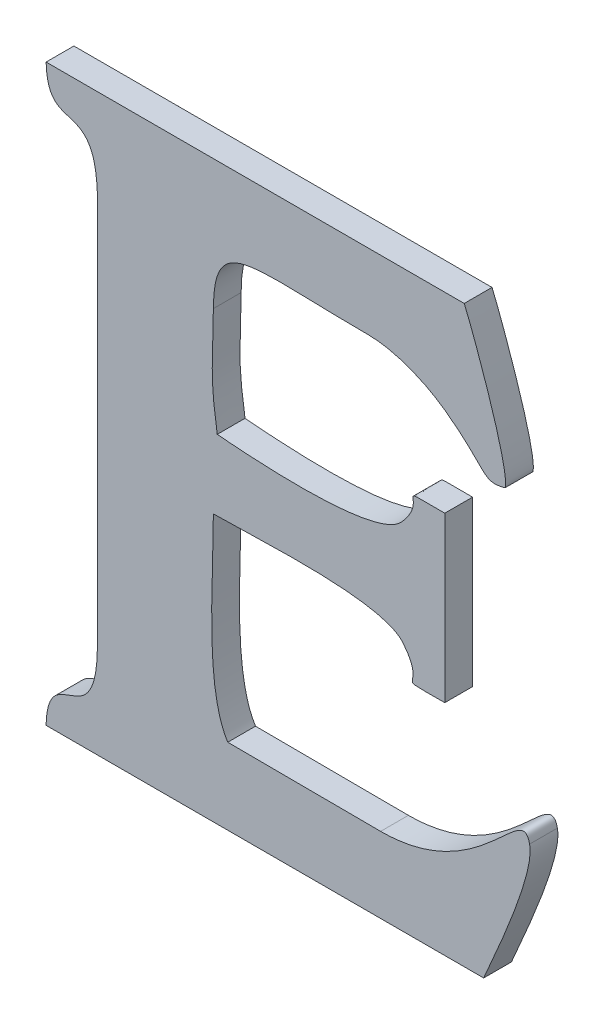
ISO-10303-21;
HEADER;
FILE_DESCRIPTION(('STEP AP214'),'2;1');
FILE_NAME('part.step','',(''),(''),'','','');
FILE_SCHEMA(('AUTOMOTIVE_DESIGN { 1 0 10303 214 1 1 1 1 }'));
ENDSEC;
DATA;
#1=APPLICATION_CONTEXT('core data for automotive mechanical design processes');
#2=APPLICATION_PROTOCOL_DEFINITION('international standard','automotive_design',2000,#1);
#3=PRODUCT_CONTEXT('',#1,'mechanical');
#4=PRODUCT('Part','Part','',(#3));
#5=PRODUCT_RELATED_PRODUCT_CATEGORY('part','',(#4));
#6=PRODUCT_DEFINITION_FORMATION('','',#4);
#7=PRODUCT_DEFINITION_CONTEXT('part definition',#1,'design');
#8=PRODUCT_DEFINITION('design','',#6,#7);
#9=PRODUCT_DEFINITION_SHAPE('','',#8);
#10=(LENGTH_UNIT() NAMED_UNIT(*) SI_UNIT(.MILLI.,.METRE.));
#11=(NAMED_UNIT(*) PLANE_ANGLE_UNIT() SI_UNIT($,.RADIAN.));
#12=(NAMED_UNIT(*) SI_UNIT($,.STERADIAN.) SOLID_ANGLE_UNIT());
#13=UNCERTAINTY_MEASURE_WITH_UNIT(LENGTH_MEASURE(1.E-05),#10,'distance_accuracy_value','');
#14=(GEOMETRIC_REPRESENTATION_CONTEXT(3) GLOBAL_UNCERTAINTY_ASSIGNED_CONTEXT((#13)) GLOBAL_UNIT_ASSIGNED_CONTEXT((#10,
#11,#12)) REPRESENTATION_CONTEXT('',''));
#15=CARTESIAN_POINT('',(0.,0.,0.));
#16=DIRECTION('',(0.,0.,1.));
#17=DIRECTION('',(1.,0.,0.));
#18=AXIS2_PLACEMENT_3D('',#15,#16,#17);
#19=CARTESIAN_POINT('',(0.,11.219925,0.001));
#20=DIRECTION('',(0.,-1.,0.));
#21=DIRECTION('',(0.,0.,-1.));
#22=AXIS2_PLACEMENT_3D('',#19,#20,#21);
#23=PLANE('',#22);
#24=DIRECTION('',(-1.,0.,0.));
#25=VECTOR('',#24,1.);
#26=CARTESIAN_POINT('',(0.,11.219925,0.));
#27=LINE('',#26,#25);
#28=CARTESIAN_POINT('',(50.2656939999998,11.219925,0.));
#29=VERTEX_POINT('',#28);
#30=CARTESIAN_POINT('',(50.2506439999998,11.219925,0.));
#31=VERTEX_POINT('',#30);
#32=EDGE_CURVE('E11',#29,#31,#27,.T.);
#33=ORIENTED_EDGE('',*,*,#32,.T.);
#34=DIRECTION('',(0.,0.,-1.));
#35=VECTOR('',#34,1.);
#36=CARTESIAN_POINT('',(50.2506439999998,11.219925,0.001));
#37=LINE('',#36,#35);
#38=CARTESIAN_POINT('',(50.2506439999998,11.219925,0.001));
#39=VERTEX_POINT('',#38);
#40=EDGE_CURVE('E24',#39,#31,#37,.T.);
#41=ORIENTED_EDGE('',*,*,#40,.F.);
#42=DIRECTION('',(-1.,0.,0.));
#43=VECTOR('',#42,1.);
#44=CARTESIAN_POINT('',(0.,11.219925,0.001));
#45=LINE('',#44,#43);
#46=CARTESIAN_POINT('',(50.2656939999998,11.219925,0.001));
#47=VERTEX_POINT('',#46);
#48=EDGE_CURVE('E427',#47,#39,#45,.T.);
#49=ORIENTED_EDGE('',*,*,#48,.F.);
#50=DIRECTION('',(0.,0.,-1.));
#51=VECTOR('',#50,1.);
#52=CARTESIAN_POINT('',(50.2656939999998,11.219925,0.001));
#53=LINE('',#52,#51);
#54=EDGE_CURVE('E166',#47,#29,#53,.T.);
#55=ORIENTED_EDGE('',*,*,#54,.T.);
#56=EDGE_LOOP('',(#33,#41,#49,#55));
#57=FACE_BOUND('',#56,.T.);
#58=ADVANCED_FACE('F17',(#57),#23,.F.);
#59=CARTESIAN_POINT('',(50.2506439999998,11.219925,0.001));
#60=CARTESIAN_POINT('',(50.2506439999998,11.219925,0.));
#61=CARTESIAN_POINT('',(50.2506999999998,11.217615,0.001));
#62=CARTESIAN_POINT('',(50.2506999999998,11.217615,0.));
#63=CARTESIAN_POINT('',(50.2524919999998,11.219813,0.001));
#64=CARTESIAN_POINT('',(50.2524919999998,11.219813,0.));
#65=CARTESIAN_POINT('',(50.2524919999998,11.216481,0.001));
#66=CARTESIAN_POINT('',(50.2524919999998,11.216481,0.));
#67=B_SPLINE_SURFACE_WITH_KNOTS('',3,1,((#59,#60),(#61,#62),(#63,#64),(#65,#66)),.UNSPECIFIED.,
.F.,.F.,.F.,(4,4),(2,2),(0.9,1.),(0.,1.),.UNSPECIFIED.);
#68=CARTESIAN_POINT('',(50.2506439999998,11.219925,0.));
#69=CARTESIAN_POINT('',(50.2506999999998,11.217615,0.));
#70=CARTESIAN_POINT('',(50.2524919999998,11.219813,0.));
#71=CARTESIAN_POINT('',(50.2524919999998,11.216481,0.));
#72=B_SPLINE_CURVE_WITH_KNOTS('',3,(#68,#69,#70,#71),.UNSPECIFIED.,.F.,.F.,(4,4),(0.9,1.),.UNSPECIFIED.);
#73=CARTESIAN_POINT('',(50.2524919999998,11.216481,0.));
#74=VERTEX_POINT('',#73);
#75=EDGE_CURVE('E418',#31,#74,#72,.T.);
#76=DIRECTION('',(0.,0.,-1.));
#77=VECTOR('',#76,1.);
#78=CARTESIAN_POINT('',(50.2524919999998,11.216481,0.001));
#79=LINE('',#78,#77);
#80=CARTESIAN_POINT('',(50.2524919999998,11.216481,0.001));
#81=VERTEX_POINT('',#80);
#82=EDGE_CURVE('E413',#81,#74,#79,.T.);
#83=CARTESIAN_POINT('',(50.2506439999998,11.219925,0.001));
#84=CARTESIAN_POINT('',(50.2506999999998,11.217615,0.001));
#85=CARTESIAN_POINT('',(50.2524919999998,11.219813,0.001));
#86=CARTESIAN_POINT('',(50.2524919999998,11.216481,0.001));
#87=B_SPLINE_CURVE_WITH_KNOTS('',3,(#83,#84,#85,#86),.UNSPECIFIED.,.F.,.F.,(4,4),(0.9,1.),.UNSPECIFIED.);
#88=EDGE_CURVE('E409',#39,#81,#87,.T.);
#89=ORIENTED_EDGE('',*,*,#75,.T.);
#90=ORIENTED_EDGE('',*,*,#82,.F.);
#91=ORIENTED_EDGE('',*,*,#88,.F.);
#92=ORIENTED_EDGE('',*,*,#40,.T.);
#93=EDGE_LOOP('',(#89,#90,#91,#92));
#94=FACE_BOUND('',#93,.T.);
#95=ADVANCED_FACE('F430',(#94),#67,.F.);
#96=CARTESIAN_POINT('',(50.2524919999998,0.,0.001));
#97=DIRECTION('',(1.,0.,0.));
#98=DIRECTION('',(0.,0.,-1.));
#99=AXIS2_PLACEMENT_3D('',#96,#97,#98);
#100=PLANE('',#99);
#101=DIRECTION('',(0.,-1.,0.));
#102=VECTOR('',#101,1.);
#103=CARTESIAN_POINT('',(50.2524919999998,0.,0.));
#104=LINE('',#103,#102);
#105=CARTESIAN_POINT('',(50.2524919999998,11.202691,0.));
#106=VERTEX_POINT('',#105);
#107=EDGE_CURVE('E407',#74,#106,#104,.T.);
#108=ORIENTED_EDGE('',*,*,#107,.T.);
#109=DIRECTION('',(0.,0.,-1.));
#110=VECTOR('',#109,1.);
#111=CARTESIAN_POINT('',(50.2524919999998,11.202691,0.001));
#112=LINE('',#111,#110);
#113=CARTESIAN_POINT('',(50.2524919999998,11.202691,0.001));
#114=VERTEX_POINT('',#113);
#115=EDGE_CURVE('E404',#114,#106,#112,.T.);
#116=ORIENTED_EDGE('',*,*,#115,.F.);
#117=DIRECTION('',(0.,-1.,0.));
#118=VECTOR('',#117,1.);
#119=CARTESIAN_POINT('',(50.2524919999998,0.,0.001));
#120=LINE('',#119,#118);
#121=EDGE_CURVE('E398',#81,#114,#120,.T.);
#122=ORIENTED_EDGE('',*,*,#121,.F.);
#123=ORIENTED_EDGE('',*,*,#82,.T.);
#124=EDGE_LOOP('',(#108,#116,#122,#123));
#125=FACE_BOUND('',#124,.T.);
#126=ADVANCED_FACE('F437',(#125),#100,.F.);
#127=CARTESIAN_POINT('',(50.2524919999998,11.202691,0.001));
#128=CARTESIAN_POINT('',(50.2524919999998,11.202691,0.));
#129=CARTESIAN_POINT('',(50.2524919999998,11.199485,0.001));
#130=CARTESIAN_POINT('',(50.2524919999998,11.199485,0.));
#131=CARTESIAN_POINT('',(50.2506999999998,11.201585,0.001));
#132=CARTESIAN_POINT('',(50.2506999999998,11.201585,0.));
#133=CARTESIAN_POINT('',(50.2506439999998,11.199247,0.001));
#134=CARTESIAN_POINT('',(50.2506439999998,11.199247,0.));
#135=B_SPLINE_SURFACE_WITH_KNOTS('',3,1,((#127,#128),(#129,#130),(#131,#132),(#133,#134)),
.UNSPECIFIED.,.F.,.F.,.F.,(4,4),(2,2),(0.05,0.1),(0.,1.),.UNSPECIFIED.);
#136=CARTESIAN_POINT('',(50.2524919999998,11.202691,0.));
#137=CARTESIAN_POINT('',(50.2524919999998,11.199485,0.));
#138=CARTESIAN_POINT('',(50.2506999999998,11.201585,0.));
#139=CARTESIAN_POINT('',(50.2506439999998,11.199247,0.));
#140=B_SPLINE_CURVE_WITH_KNOTS('',3,(#136,#137,#138,#139),.UNSPECIFIED.,.F.,.F.,(4,4),(0.05,
0.1),.UNSPECIFIED.);
#141=CARTESIAN_POINT('',(50.2506439999998,11.199247,0.));
#142=VERTEX_POINT('',#141);
#143=EDGE_CURVE('E393',#106,#142,#140,.T.);
#144=DIRECTION('',(0.,0.,-1.));
#145=VECTOR('',#144,1.);
#146=CARTESIAN_POINT('',(50.2506439999998,11.199247,0.001));
#147=LINE('',#146,#145);
#148=CARTESIAN_POINT('',(50.2506439999998,11.199247,0.001));
#149=VERTEX_POINT('',#148);
#150=EDGE_CURVE('E388',#149,#142,#147,.T.);
#151=CARTESIAN_POINT('',(50.2524919999998,11.202691,0.001));
#152=CARTESIAN_POINT('',(50.2524919999998,11.199485,0.001));
#153=CARTESIAN_POINT('',(50.2506999999998,11.201585,0.001));
#154=CARTESIAN_POINT('',(50.2506439999998,11.199247,0.001));
#155=B_SPLINE_CURVE_WITH_KNOTS('',3,(#151,#152,#153,#154),.UNSPECIFIED.,.F.,.F.,(4,4),(0.05,
0.1),.UNSPECIFIED.);
#156=EDGE_CURVE('E384',#114,#149,#155,.T.);
#157=ORIENTED_EDGE('',*,*,#143,.T.);
#158=ORIENTED_EDGE('',*,*,#150,.F.);
#159=ORIENTED_EDGE('',*,*,#156,.F.);
#160=ORIENTED_EDGE('',*,*,#115,.T.);
#161=EDGE_LOOP('',(#157,#158,#159,#160));
#162=FACE_BOUND('',#161,.T.);
#163=ADVANCED_FACE('F441',(#162),#135,.F.);
#164=CARTESIAN_POINT('',(0.,11.199247,0.001));
#165=DIRECTION('',(0.,1.,0.));
#166=DIRECTION('',(0.,0.,1.));
#167=AXIS2_PLACEMENT_3D('',#164,#165,#166);
#168=PLANE('',#167);
#169=DIRECTION('',(1.,0.,0.));
#170=VECTOR('',#169,1.);
#171=CARTESIAN_POINT('',(0.,11.199247,0.));
#172=LINE('',#171,#170);
#173=CARTESIAN_POINT('',(50.2663939999998,11.199247,0.));
#174=VERTEX_POINT('',#173);
#175=EDGE_CURVE('E382',#142,#174,#172,.T.);
#176=ORIENTED_EDGE('',*,*,#175,.T.);
#177=DIRECTION('',(0.,0.,-1.));
#178=VECTOR('',#177,1.);
#179=CARTESIAN_POINT('',(50.2663939999998,11.199247,0.001));
#180=LINE('',#179,#178);
#181=CARTESIAN_POINT('',(50.2663939999998,11.199247,0.001));
#182=VERTEX_POINT('',#181);
#183=EDGE_CURVE('E379',#182,#174,#180,.T.);
#184=ORIENTED_EDGE('',*,*,#183,.F.);
#185=DIRECTION('',(1.,0.,0.));
#186=VECTOR('',#185,1.);
#187=CARTESIAN_POINT('',(0.,11.199247,0.001));
#188=LINE('',#187,#186);
#189=EDGE_CURVE('E373',#149,#182,#188,.T.);
#190=ORIENTED_EDGE('',*,*,#189,.F.);
#191=ORIENTED_EDGE('',*,*,#150,.T.);
#192=EDGE_LOOP('',(#176,#184,#190,#191));
#193=FACE_BOUND('',#192,.T.);
#194=ADVANCED_FACE('F501',(#193),#168,.F.);
#195=CARTESIAN_POINT('',(50.2663939999998,11.199247,0.001));
#196=CARTESIAN_POINT('',(50.2663939999998,11.199247,0.));
#197=CARTESIAN_POINT('',(50.2667579999998,11.200101,0.001));
#198=CARTESIAN_POINT('',(50.2667579999998,11.200101,0.));
#199=CARTESIAN_POINT('',(50.2682559999998,11.203349,0.001));
#200=CARTESIAN_POINT('',(50.2682559999998,11.203349,0.));
#201=CARTESIAN_POINT('',(50.2680459999998,11.204245,0.001));
#202=CARTESIAN_POINT('',(50.2680459999998,11.204245,0.));
#203=B_SPLINE_SURFACE_WITH_KNOTS('',3,1,((#195,#196),(#197,#198),(#199,#200),(#201,#202)),
.UNSPECIFIED.,.F.,.F.,.F.,(4,4),(2,2),(0.15,0.2),(0.,1.),.UNSPECIFIED.);
#204=CARTESIAN_POINT('',(50.2663939999998,11.199247,0.));
#205=CARTESIAN_POINT('',(50.2667579999998,11.200101,0.));
#206=CARTESIAN_POINT('',(50.2682559999998,11.203349,0.));
#207=CARTESIAN_POINT('',(50.2680459999998,11.204245,0.));
#208=B_SPLINE_CURVE_WITH_KNOTS('',3,(#204,#205,#206,#207),.UNSPECIFIED.,.F.,.F.,(4,4),(0.15,
0.2),.UNSPECIFIED.);
#209=CARTESIAN_POINT('',(50.2680459999998,11.204245,0.));
#210=VERTEX_POINT('',#209);
#211=EDGE_CURVE('E368',#174,#210,#208,.T.);
#212=DIRECTION('',(0.,0.,-1.));
#213=VECTOR('',#212,1.);
#214=CARTESIAN_POINT('',(50.2680459999998,11.204245,0.001));
#215=LINE('',#214,#213);
#216=CARTESIAN_POINT('',(50.2680459999998,11.204245,0.001));
#217=VERTEX_POINT('',#216);
#218=EDGE_CURVE('E363',#217,#210,#215,.T.);
#219=CARTESIAN_POINT('',(50.2663939999998,11.199247,0.001));
#220=CARTESIAN_POINT('',(50.2667579999998,11.200101,0.001));
#221=CARTESIAN_POINT('',(50.2682559999998,11.203349,0.001));
#222=CARTESIAN_POINT('',(50.2680459999998,11.204245,0.001));
#223=B_SPLINE_CURVE_WITH_KNOTS('',3,(#219,#220,#221,#222),.UNSPECIFIED.,.F.,.F.,(4,4),(0.15,
0.2),.UNSPECIFIED.);
#224=EDGE_CURVE('E356',#182,#217,#223,.T.);
#225=ORIENTED_EDGE('',*,*,#211,.T.);
#226=ORIENTED_EDGE('',*,*,#218,.F.);
#227=ORIENTED_EDGE('',*,*,#224,.F.);
#228=ORIENTED_EDGE('',*,*,#183,.T.);
#229=EDGE_LOOP('',(#225,#226,#227,#228));
#230=FACE_BOUND('',#229,.T.);
#231=ADVANCED_FACE('F499',(#230),#203,.F.);
#232=CARTESIAN_POINT('',(50.2680459999998,11.204245,0.001));
#233=CARTESIAN_POINT('',(50.2680459999998,11.204245,0.));
#234=CARTESIAN_POINT('',(50.2677659999998,11.205575,0.001));
#235=CARTESIAN_POINT('',(50.2677659999998,11.205575,0.));
#236=CARTESIAN_POINT('',(50.2663379999998,11.201963,0.001));
#237=CARTESIAN_POINT('',(50.2663379999998,11.201963,0.));
#238=CARTESIAN_POINT('',(50.2626839999998,11.201963,0.001));
#239=CARTESIAN_POINT('',(50.2626839999998,11.201963,0.));
#240=B_SPLINE_SURFACE_WITH_KNOTS('',3,1,((#232,#233),(#234,#235),(#236,#237),(#238,#239)),
.UNSPECIFIED.,.F.,.F.,.F.,(4,4),(2,2),(0.2,0.25),(0.,1.),.UNSPECIFIED.);
#241=CARTESIAN_POINT('',(50.2680459999998,11.204245,0.));
#242=CARTESIAN_POINT('',(50.2677659999998,11.205575,0.));
#243=CARTESIAN_POINT('',(50.2663379999998,11.201963,0.));
#244=CARTESIAN_POINT('',(50.2626839999998,11.201963,0.));
#245=B_SPLINE_CURVE_WITH_KNOTS('',3,(#241,#242,#243,#244),.UNSPECIFIED.,.F.,.F.,(4,4),(0.2,
0.25),.UNSPECIFIED.);
#246=CARTESIAN_POINT('',(50.2626839999998,11.201963,0.));
#247=VERTEX_POINT('',#246);
#248=EDGE_CURVE('E351',#210,#247,#245,.T.);
#249=DIRECTION('',(0.,0.,-1.));
#250=VECTOR('',#249,1.);
#251=CARTESIAN_POINT('',(50.2626839999998,11.201963,0.001));
#252=LINE('',#251,#250);
#253=CARTESIAN_POINT('',(50.2626839999998,11.201963,0.001));
#254=VERTEX_POINT('',#253);
#255=EDGE_CURVE('E346',#254,#247,#252,.T.);
#256=CARTESIAN_POINT('',(50.2680459999998,11.204245,0.001));
#257=CARTESIAN_POINT('',(50.2677659999998,11.205575,0.001));
#258=CARTESIAN_POINT('',(50.2663379999998,11.201963,0.001));
#259=CARTESIAN_POINT('',(50.2626839999998,11.201963,0.001));
#260=B_SPLINE_CURVE_WITH_KNOTS('',3,(#256,#257,#258,#259),.UNSPECIFIED.,.F.,.F.,(4,4),(0.2,
0.25),.UNSPECIFIED.);
#261=EDGE_CURVE('E342',#217,#254,#260,.T.);
#262=ORIENTED_EDGE('',*,*,#248,.T.);
#263=ORIENTED_EDGE('',*,*,#255,.F.);
#264=ORIENTED_EDGE('',*,*,#261,.F.);
#265=ORIENTED_EDGE('',*,*,#218,.T.);
#266=EDGE_LOOP('',(#262,#263,#264,#265));
#267=FACE_BOUND('',#266,.T.);
#268=ADVANCED_FACE('F495',(#267),#240,.F.);
#269=CARTESIAN_POINT('',(0.0583076641716466,11.4574560093511,0.001));
#270=DIRECTION('',(-0.0050889926260872,-0.999987050993188,0.));
#271=DIRECTION('',(0.999987050993188,-0.0050889926260872,0.));
#272=AXIS2_PLACEMENT_3D('',#269,#270,#271);
#273=PLANE('',#272);
#274=DIRECTION('',(-0.999987050993187,0.0050889926260872,0.));
#275=VECTOR('',#274,1.);
#276=CARTESIAN_POINT('',(0.0583076641716466,11.4574560093511,0.));
#277=LINE('',#276,#275);
#278=CARTESIAN_POINT('',(50.2571819999998,11.201991,0.));
#279=VERTEX_POINT('',#278);
#280=EDGE_CURVE('E340',#247,#279,#277,.T.);
#281=ORIENTED_EDGE('',*,*,#280,.T.);
#282=DIRECTION('',(0.,0.,-1.));
#283=VECTOR('',#282,1.);
#284=CARTESIAN_POINT('',(50.2571819999998,11.201991,0.001));
#285=LINE('',#284,#283);
#286=CARTESIAN_POINT('',(50.2571819999998,11.201991,0.001));
#287=VERTEX_POINT('',#286);
#288=EDGE_CURVE('E337',#287,#279,#285,.T.);
#289=ORIENTED_EDGE('',*,*,#288,.F.);
#290=DIRECTION('',(-0.999987050993187,0.0050889926260872,0.));
#291=VECTOR('',#290,1.);
#292=CARTESIAN_POINT('',(0.0583076641716466,11.4574560093511,0.001));
#293=LINE('',#292,#291);
#294=EDGE_CURVE('E331',#254,#287,#293,.T.);
#295=ORIENTED_EDGE('',*,*,#294,.F.);
#296=ORIENTED_EDGE('',*,*,#255,.T.);
#297=EDGE_LOOP('',(#281,#289,#295,#296));
#298=FACE_BOUND('',#297,.T.);
#299=ADVANCED_FACE('F490',(#298),#273,.F.);
#300=CARTESIAN_POINT('',(50.2571819999998,11.201991,0.001));
#301=CARTESIAN_POINT('',(50.2571819999998,11.201991,0.));
#302=CARTESIAN_POINT('',(50.2563419999998,11.203293,0.001));
#303=CARTESIAN_POINT('',(50.2563419999998,11.203293,0.));
#304=CARTESIAN_POINT('',(50.2566639999998,11.206709,0.001));
#305=CARTESIAN_POINT('',(50.2566639999998,11.206709,0.));
#306=CARTESIAN_POINT('',(50.2566639999998,11.208851,0.001));
#307=CARTESIAN_POINT('',(50.2566639999998,11.208851,0.));
#308=B_SPLINE_SURFACE_WITH_KNOTS('',3,1,((#300,#301),(#302,#303),(#304,#305),(#306,#307)),
.UNSPECIFIED.,.F.,.F.,.F.,(4,4),(2,2),(0.3,0.35),(0.,1.),.UNSPECIFIED.);
#309=CARTESIAN_POINT('',(50.2571819999998,11.201991,0.));
#310=CARTESIAN_POINT('',(50.2563419999998,11.203293,0.));
#311=CARTESIAN_POINT('',(50.2566639999998,11.206709,0.));
#312=CARTESIAN_POINT('',(50.2566639999998,11.208851,0.));
#313=B_SPLINE_CURVE_WITH_KNOTS('',3,(#309,#310,#311,#312),.UNSPECIFIED.,.F.,.F.,(4,4),(0.3,
0.35),.UNSPECIFIED.);
#314=CARTESIAN_POINT('',(50.2566639999998,11.208851,0.));
#315=VERTEX_POINT('',#314);
#316=EDGE_CURVE('E326',#279,#315,#313,.T.);
#317=DIRECTION('',(0.,0.,-1.));
#318=VECTOR('',#317,1.);
#319=CARTESIAN_POINT('',(50.2566639999998,11.208851,0.001));
#320=LINE('',#319,#318);
#321=CARTESIAN_POINT('',(50.2566639999998,11.208851,0.001));
#322=VERTEX_POINT('',#321);
#323=EDGE_CURVE('E321',#322,#315,#320,.T.);
#324=CARTESIAN_POINT('',(50.2571819999998,11.201991,0.001));
#325=CARTESIAN_POINT('',(50.2563419999998,11.203293,0.001));
#326=CARTESIAN_POINT('',(50.2566639999998,11.206709,0.001));
#327=CARTESIAN_POINT('',(50.2566639999998,11.208851,0.001));
#328=B_SPLINE_CURVE_WITH_KNOTS('',3,(#324,#325,#326,#327),.UNSPECIFIED.,.F.,.F.,(4,4),(0.3,
0.35),.UNSPECIFIED.);
#329=EDGE_CURVE('E314',#287,#322,#328,.T.);
#330=ORIENTED_EDGE('',*,*,#316,.T.);
#331=ORIENTED_EDGE('',*,*,#323,.F.);
#332=ORIENTED_EDGE('',*,*,#329,.F.);
#333=ORIENTED_EDGE('',*,*,#288,.T.);
#334=EDGE_LOOP('',(#330,#331,#332,#333));
#335=FACE_BOUND('',#334,.T.);
#336=ADVANCED_FACE('F487',(#335),#308,.F.);
#337=CARTESIAN_POINT('',(50.2566639999998,11.208851,0.001));
#338=CARTESIAN_POINT('',(50.2566639999998,11.208851,0.));
#339=CARTESIAN_POINT('',(50.2582319999998,11.208851,0.001));
#340=CARTESIAN_POINT('',(50.2582319999998,11.208851,0.));
#341=CARTESIAN_POINT('',(50.2627399999998,11.209187,0.001));
#342=CARTESIAN_POINT('',(50.2627399999998,11.209187,0.));
#343=CARTESIAN_POINT('',(50.2634959999998,11.208235,0.001));
#344=CARTESIAN_POINT('',(50.2634959999998,11.208235,0.));
#345=B_SPLINE_SURFACE_WITH_KNOTS('',3,1,((#337,#338),(#339,#340),(#341,#342),(#343,#344)),
.UNSPECIFIED.,.F.,.F.,.F.,(4,4),(2,2),(0.35,0.4),(0.,1.),.UNSPECIFIED.);
#346=CARTESIAN_POINT('',(50.2566639999998,11.208851,0.));
#347=CARTESIAN_POINT('',(50.2582319999998,11.208851,0.));
#348=CARTESIAN_POINT('',(50.2627399999998,11.209187,0.));
#349=CARTESIAN_POINT('',(50.2634959999998,11.208235,0.));
#350=B_SPLINE_CURVE_WITH_KNOTS('',3,(#346,#347,#348,#349),.UNSPECIFIED.,.F.,.F.,(4,4),(0.35,
0.4),.UNSPECIFIED.);
#351=CARTESIAN_POINT('',(50.2634959999998,11.208235,0.));
#352=VERTEX_POINT('',#351);
#353=EDGE_CURVE('E309',#315,#352,#350,.T.);
#354=DIRECTION('',(0.,0.,-1.));
#355=VECTOR('',#354,1.);
#356=CARTESIAN_POINT('',(50.2634959999998,11.208235,0.001));
#357=LINE('',#356,#355);
#358=CARTESIAN_POINT('',(50.2634959999998,11.208235,0.001));
#359=VERTEX_POINT('',#358);
#360=EDGE_CURVE('E304',#359,#352,#357,.T.);
#361=CARTESIAN_POINT('',(50.2566639999998,11.208851,0.001));
#362=CARTESIAN_POINT('',(50.2582319999998,11.208851,0.001));
#363=CARTESIAN_POINT('',(50.2627399999998,11.209187,0.001));
#364=CARTESIAN_POINT('',(50.2634959999998,11.208235,0.001));
#365=B_SPLINE_CURVE_WITH_KNOTS('',3,(#361,#362,#363,#364),.UNSPECIFIED.,.F.,.F.,(4,4),(0.35,
0.4),.UNSPECIFIED.);
#366=EDGE_CURVE('E297',#322,#359,#365,.T.);
#367=ORIENTED_EDGE('',*,*,#353,.T.);
#368=ORIENTED_EDGE('',*,*,#360,.F.);
#369=ORIENTED_EDGE('',*,*,#366,.F.);
#370=ORIENTED_EDGE('',*,*,#323,.T.);
#371=EDGE_LOOP('',(#367,#368,#369,#370));
#372=FACE_BOUND('',#371,.T.);
#373=ADVANCED_FACE('F483',(#372),#345,.F.);
#374=CARTESIAN_POINT('',(50.2634959999998,11.208235,0.001));
#375=CARTESIAN_POINT('',(50.2634959999998,11.208235,0.));
#376=CARTESIAN_POINT('',(50.2644619999998,11.207031,0.001));
#377=CARTESIAN_POINT('',(50.2644619999998,11.207031,0.));
#378=CARTESIAN_POINT('',(50.2629079999998,11.207129,0.001));
#379=CARTESIAN_POINT('',(50.2629079999998,11.207129,0.));
#380=CARTESIAN_POINT('',(50.2649939999998,11.207129,0.001));
#381=CARTESIAN_POINT('',(50.2649939999998,11.207129,0.));
#382=B_SPLINE_SURFACE_WITH_KNOTS('',3,1,((#374,#375),(#376,#377),(#378,#379),(#380,#381)),
.UNSPECIFIED.,.F.,.F.,.F.,(4,4),(2,2),(0.4,0.45),(0.,1.),.UNSPECIFIED.);
#383=CARTESIAN_POINT('',(50.2634959999998,11.208235,0.));
#384=CARTESIAN_POINT('',(50.2644619999998,11.207031,0.));
#385=CARTESIAN_POINT('',(50.2629079999998,11.207129,0.));
#386=CARTESIAN_POINT('',(50.2649939999998,11.207129,0.));
#387=B_SPLINE_CURVE_WITH_KNOTS('',3,(#383,#384,#385,#386),.UNSPECIFIED.,.F.,.F.,(4,4),(0.4,
0.45),.UNSPECIFIED.);
#388=CARTESIAN_POINT('',(50.2649939999998,11.207129,0.));
#389=VERTEX_POINT('',#388);
#390=EDGE_CURVE('E292',#352,#389,#387,.T.);
#391=DIRECTION('',(0.,0.,-1.));
#392=VECTOR('',#391,1.);
#393=CARTESIAN_POINT('',(50.2649939999998,11.207129,0.001));
#394=LINE('',#393,#392);
#395=CARTESIAN_POINT('',(50.2649939999998,11.207129,0.001));
#396=VERTEX_POINT('',#395);
#397=EDGE_CURVE('E287',#396,#389,#394,.T.);
#398=CARTESIAN_POINT('',(50.2634959999998,11.208235,0.001));
#399=CARTESIAN_POINT('',(50.2644619999998,11.207031,0.001));
#400=CARTESIAN_POINT('',(50.2629079999998,11.207129,0.001));
#401=CARTESIAN_POINT('',(50.2649939999998,11.207129,0.001));
#402=B_SPLINE_CURVE_WITH_KNOTS('',3,(#398,#399,#400,#401),.UNSPECIFIED.,.F.,.F.,(4,4),(0.4,
0.45),.UNSPECIFIED.);
#403=EDGE_CURVE('E283',#359,#396,#402,.T.);
#404=ORIENTED_EDGE('',*,*,#390,.T.);
#405=ORIENTED_EDGE('',*,*,#397,.F.);
#406=ORIENTED_EDGE('',*,*,#403,.F.);
#407=ORIENTED_EDGE('',*,*,#360,.T.);
#408=EDGE_LOOP('',(#404,#405,#406,#407));
#409=FACE_BOUND('',#408,.T.);
#410=ADVANCED_FACE('F477',(#409),#382,.F.);
#411=CARTESIAN_POINT('',(50.2649939999998,0.,0.001));
#412=DIRECTION('',(-1.,0.,0.));
#413=DIRECTION('',(0.,0.,1.));
#414=AXIS2_PLACEMENT_3D('',#411,#412,#413);
#415=PLANE('',#414);
#416=DIRECTION('',(0.,1.,0.));
#417=VECTOR('',#416,1.);
#418=CARTESIAN_POINT('',(50.2649939999998,0.,0.));
#419=LINE('',#418,#417);
#420=CARTESIAN_POINT('',(50.2649939999998,11.213037,0.));
#421=VERTEX_POINT('',#420);
#422=EDGE_CURVE('E281',#389,#421,#419,.T.);
#423=ORIENTED_EDGE('',*,*,#422,.T.);
#424=DIRECTION('',(0.,0.,-1.));
#425=VECTOR('',#424,1.);
#426=CARTESIAN_POINT('',(50.2649939999998,11.213037,0.001));
#427=LINE('',#426,#425);
#428=CARTESIAN_POINT('',(50.2649939999998,11.213037,0.001));
#429=VERTEX_POINT('',#428);
#430=EDGE_CURVE('E278',#429,#421,#427,.T.);
#431=ORIENTED_EDGE('',*,*,#430,.F.);
#432=DIRECTION('',(0.,1.,0.));
#433=VECTOR('',#432,1.);
#434=CARTESIAN_POINT('',(50.2649939999998,0.,0.001));
#435=LINE('',#434,#433);
#436=EDGE_CURVE('E272',#396,#429,#435,.T.);
#437=ORIENTED_EDGE('',*,*,#436,.F.);
#438=ORIENTED_EDGE('',*,*,#397,.T.);
#439=EDGE_LOOP('',(#423,#431,#437,#438));
#440=FACE_BOUND('',#439,.T.);
#441=ADVANCED_FACE('F471',(#440),#415,.F.);
#442=CARTESIAN_POINT('',(50.2649939999998,11.213037,0.001));
#443=CARTESIAN_POINT('',(50.2649939999998,11.213037,0.));
#444=CARTESIAN_POINT('',(50.2629499999998,11.213037,0.001));
#445=CARTESIAN_POINT('',(50.2629499999998,11.213037,0.));
#446=CARTESIAN_POINT('',(50.2645039999998,11.213177,0.001));
#447=CARTESIAN_POINT('',(50.2645039999998,11.213177,0.));
#448=CARTESIAN_POINT('',(50.2634399999998,11.211987,0.001));
#449=CARTESIAN_POINT('',(50.2634399999998,11.211987,0.));
#450=B_SPLINE_SURFACE_WITH_KNOTS('',3,1,((#442,#443),(#444,#445),(#446,#447),(#448,#449)),
.UNSPECIFIED.,.F.,.F.,.F.,(4,4),(2,2),(0.5,0.55),(0.,1.),.UNSPECIFIED.);
#451=CARTESIAN_POINT('',(50.2649939999998,11.213037,0.));
#452=CARTESIAN_POINT('',(50.2629499999998,11.213037,0.));
#453=CARTESIAN_POINT('',(50.2645039999998,11.213177,0.));
#454=CARTESIAN_POINT('',(50.2634399999998,11.211987,0.));
#455=B_SPLINE_CURVE_WITH_KNOTS('',3,(#451,#452,#453,#454),.UNSPECIFIED.,.F.,.F.,(4,4),(0.5,
0.55),.UNSPECIFIED.);
#456=CARTESIAN_POINT('',(50.2634399999998,11.211987,0.));
#457=VERTEX_POINT('',#456);
#458=EDGE_CURVE('E267',#421,#457,#455,.T.);
#459=DIRECTION('',(0.,0.,-1.));
#460=VECTOR('',#459,1.);
#461=CARTESIAN_POINT('',(50.2634399999998,11.211987,0.001));
#462=LINE('',#461,#460);
#463=CARTESIAN_POINT('',(50.2634399999998,11.211987,0.001));
#464=VERTEX_POINT('',#463);
#465=EDGE_CURVE('E262',#464,#457,#462,.T.);
#466=CARTESIAN_POINT('',(50.2649939999998,11.213037,0.001));
#467=CARTESIAN_POINT('',(50.2629499999998,11.213037,0.001));
#468=CARTESIAN_POINT('',(50.2645039999998,11.213177,0.001));
#469=CARTESIAN_POINT('',(50.2634399999998,11.211987,0.001));
#470=B_SPLINE_CURVE_WITH_KNOTS('',3,(#466,#467,#468,#469),.UNSPECIFIED.,.F.,.F.,(4,4),(0.5,
0.55),.UNSPECIFIED.);
#471=EDGE_CURVE('E255',#429,#464,#470,.T.);
#472=ORIENTED_EDGE('',*,*,#458,.T.);
#473=ORIENTED_EDGE('',*,*,#465,.F.);
#474=ORIENTED_EDGE('',*,*,#471,.F.);
#475=ORIENTED_EDGE('',*,*,#430,.T.);
#476=EDGE_LOOP('',(#472,#473,#474,#475));
#477=FACE_BOUND('',#476,.T.);
#478=ADVANCED_FACE('F468',(#477),#450,.F.);
#479=CARTESIAN_POINT('',(50.2634399999998,11.211987,0.001));
#480=CARTESIAN_POINT('',(50.2634399999998,11.211987,0.));
#481=CARTESIAN_POINT('',(50.2625159999998,11.210965,0.001));
#482=CARTESIAN_POINT('',(50.2625159999998,11.210965,0.));
#483=CARTESIAN_POINT('',(50.2582319999998,11.211273,0.001));
#484=CARTESIAN_POINT('',(50.2582319999998,11.211273,0.));
#485=CARTESIAN_POINT('',(50.2568039999998,11.211399,0.001));
#486=CARTESIAN_POINT('',(50.2568039999998,11.211399,0.));
#487=B_SPLINE_SURFACE_WITH_KNOTS('',3,1,((#479,#480),(#481,#482),(#483,#484),(#485,#486)),
.UNSPECIFIED.,.F.,.F.,.F.,(4,4),(2,2),(0.55,0.6),(0.,1.),.UNSPECIFIED.);
#488=CARTESIAN_POINT('',(50.2634399999998,11.211987,0.));
#489=CARTESIAN_POINT('',(50.2625159999998,11.210965,0.));
#490=CARTESIAN_POINT('',(50.2582319999998,11.211273,0.));
#491=CARTESIAN_POINT('',(50.2568039999998,11.211399,0.));
#492=B_SPLINE_CURVE_WITH_KNOTS('',3,(#488,#489,#490,#491),.UNSPECIFIED.,.F.,.F.,(4,4),(0.55,
0.6),.UNSPECIFIED.);
#493=CARTESIAN_POINT('',(50.2568039999998,11.211399,0.));
#494=VERTEX_POINT('',#493);
#495=EDGE_CURVE('E250',#457,#494,#492,.T.);
#496=DIRECTION('',(0.,0.,-1.));
#497=VECTOR('',#496,1.);
#498=CARTESIAN_POINT('',(50.2568039999998,11.211399,0.001));
#499=LINE('',#498,#497);
#500=CARTESIAN_POINT('',(50.2568039999998,11.211399,0.001));
#501=VERTEX_POINT('',#500);
#502=EDGE_CURVE('E245',#501,#494,#499,.T.);
#503=CARTESIAN_POINT('',(50.2634399999998,11.211987,0.001));
#504=CARTESIAN_POINT('',(50.2625159999998,11.210965,0.001));
#505=CARTESIAN_POINT('',(50.2582319999998,11.211273,0.001));
#506=CARTESIAN_POINT('',(50.2568039999998,11.211399,0.001));
#507=B_SPLINE_CURVE_WITH_KNOTS('',3,(#503,#504,#505,#506),.UNSPECIFIED.,.F.,.F.,(4,4),(0.55,
0.6),.UNSPECIFIED.);
#508=EDGE_CURVE('E238',#464,#501,#507,.T.);
#509=ORIENTED_EDGE('',*,*,#495,.T.);
#510=ORIENTED_EDGE('',*,*,#502,.F.);
#511=ORIENTED_EDGE('',*,*,#508,.F.);
#512=ORIENTED_EDGE('',*,*,#465,.T.);
#513=EDGE_LOOP('',(#509,#510,#511,#512));
#514=FACE_BOUND('',#513,.T.);
#515=ADVANCED_FACE('F463',(#514),#487,.F.);
#516=CARTESIAN_POINT('',(50.2568039999998,11.211399,0.001));
#517=CARTESIAN_POINT('',(50.2568039999998,11.211399,0.));
#518=CARTESIAN_POINT('',(50.2565239999998,11.213219,0.001));
#519=CARTESIAN_POINT('',(50.2565239999998,11.213219,0.));
#520=CARTESIAN_POINT('',(50.2566499999998,11.213331,0.001));
#521=CARTESIAN_POINT('',(50.2566499999998,11.213331,0.));
#522=CARTESIAN_POINT('',(50.2566639999998,11.215249,0.001));
#523=CARTESIAN_POINT('',(50.2566639999998,11.215249,0.));
#524=B_SPLINE_SURFACE_WITH_KNOTS('',3,1,((#516,#517),(#518,#519),(#520,#521),(#522,#523)),
.UNSPECIFIED.,.F.,.F.,.F.,(4,4),(2,2),(0.6,0.65),(0.,1.),.UNSPECIFIED.);
#525=CARTESIAN_POINT('',(50.2568039999998,11.211399,0.));
#526=CARTESIAN_POINT('',(50.2565239999998,11.213219,0.));
#527=CARTESIAN_POINT('',(50.2566499999998,11.213331,0.));
#528=CARTESIAN_POINT('',(50.2566639999998,11.215249,0.));
#529=B_SPLINE_CURVE_WITH_KNOTS('',3,(#525,#526,#527,#528),.UNSPECIFIED.,.F.,.F.,(4,4),(0.6,
0.65),.UNSPECIFIED.);
#530=CARTESIAN_POINT('',(50.2566639999998,11.215249,0.));
#531=VERTEX_POINT('',#530);
#532=EDGE_CURVE('E233',#494,#531,#529,.T.);
#533=DIRECTION('',(0.,0.,-1.));
#534=VECTOR('',#533,1.);
#535=CARTESIAN_POINT('',(50.2566639999998,11.215249,0.001));
#536=LINE('',#535,#534);
#537=CARTESIAN_POINT('',(50.2566639999998,11.215249,0.001));
#538=VERTEX_POINT('',#537);
#539=EDGE_CURVE('E228',#538,#531,#536,.T.);
#540=CARTESIAN_POINT('',(50.2568039999998,11.211399,0.001));
#541=CARTESIAN_POINT('',(50.2565239999998,11.213219,0.001));
#542=CARTESIAN_POINT('',(50.2566499999998,11.213331,0.001));
#543=CARTESIAN_POINT('',(50.2566639999998,11.215249,0.001));
#544=B_SPLINE_CURVE_WITH_KNOTS('',3,(#540,#541,#542,#543),.UNSPECIFIED.,.F.,.F.,(4,4),(0.6,
0.65),.UNSPECIFIED.);
#545=EDGE_CURVE('E221',#501,#538,#544,.T.);
#546=ORIENTED_EDGE('',*,*,#532,.T.);
#547=ORIENTED_EDGE('',*,*,#539,.F.);
#548=ORIENTED_EDGE('',*,*,#545,.F.);
#549=ORIENTED_EDGE('',*,*,#502,.T.);
#550=EDGE_LOOP('',(#546,#547,#548,#549));
#551=FACE_BOUND('',#550,.T.);
#552=ADVANCED_FACE('F457',(#551),#524,.F.);
#553=CARTESIAN_POINT('',(50.2566639999998,11.215249,0.001));
#554=CARTESIAN_POINT('',(50.2566639999998,11.215249,0.));
#555=CARTESIAN_POINT('',(50.2566779999998,11.217797,0.001));
#556=CARTESIAN_POINT('',(50.2566779999998,11.217797,0.));
#557=CARTESIAN_POINT('',(50.2579659999998,11.217223,0.001));
#558=CARTESIAN_POINT('',(50.2579659999998,11.217223,0.));
#559=CARTESIAN_POINT('',(50.2622219999998,11.217223,0.001));
#560=CARTESIAN_POINT('',(50.2622219999998,11.217223,0.));
#561=B_SPLINE_SURFACE_WITH_KNOTS('',3,1,((#553,#554),(#555,#556),(#557,#558),(#559,#560)),
.UNSPECIFIED.,.F.,.F.,.F.,(4,4),(2,2),(0.65,0.7),(0.,1.),.UNSPECIFIED.);
#562=CARTESIAN_POINT('',(50.2566639999998,11.215249,0.));
#563=CARTESIAN_POINT('',(50.2566779999998,11.217797,0.));
#564=CARTESIAN_POINT('',(50.2579659999998,11.217223,0.));
#565=CARTESIAN_POINT('',(50.2622219999998,11.217223,0.));
#566=B_SPLINE_CURVE_WITH_KNOTS('',3,(#562,#563,#564,#565),.UNSPECIFIED.,.F.,.F.,(4,4),(0.65,
0.7),.UNSPECIFIED.);
#567=CARTESIAN_POINT('',(50.2622219999998,11.217223,0.));
#568=VERTEX_POINT('',#567);
#569=EDGE_CURVE('E216',#531,#568,#566,.T.);
#570=DIRECTION('',(0.,0.,-1.));
#571=VECTOR('',#570,1.);
#572=CARTESIAN_POINT('',(50.2622219999998,11.217223,0.001));
#573=LINE('',#572,#571);
#574=CARTESIAN_POINT('',(50.2622219999998,11.217223,0.001));
#575=VERTEX_POINT('',#574);
#576=EDGE_CURVE('E211',#575,#568,#573,.T.);
#577=CARTESIAN_POINT('',(50.2566639999998,11.215249,0.001));
#578=CARTESIAN_POINT('',(50.2566779999998,11.217797,0.001));
#579=CARTESIAN_POINT('',(50.2579659999998,11.217223,0.001));
#580=CARTESIAN_POINT('',(50.2622219999998,11.217223,0.001));
#581=B_SPLINE_CURVE_WITH_KNOTS('',3,(#577,#578,#579,#580),.UNSPECIFIED.,.F.,.F.,(4,4),(0.65,
0.7),.UNSPECIFIED.);
#582=EDGE_CURVE('E204',#538,#575,#581,.T.);
#583=ORIENTED_EDGE('',*,*,#569,.T.);
#584=ORIENTED_EDGE('',*,*,#576,.F.);
#585=ORIENTED_EDGE('',*,*,#582,.F.);
#586=ORIENTED_EDGE('',*,*,#539,.T.);
#587=EDGE_LOOP('',(#583,#584,#585,#586));
#588=FACE_BOUND('',#587,.T.);
#589=ADVANCED_FACE('F453',(#588),#561,.F.);
#590=CARTESIAN_POINT('',(50.2622219999998,11.217223,0.001));
#591=CARTESIAN_POINT('',(50.2622219999998,11.217223,0.));
#592=CARTESIAN_POINT('',(50.2631739999998,11.217223,0.001));
#593=CARTESIAN_POINT('',(50.2631739999998,11.217223,0.));
#594=CARTESIAN_POINT('',(50.2642519999998,11.216789,0.001));
#595=CARTESIAN_POINT('',(50.2642519999998,11.216789,0.));
#596=CARTESIAN_POINT('',(50.2650079999998,11.216243,0.001));
#597=CARTESIAN_POINT('',(50.2650079999998,11.216243,0.));
#598=B_SPLINE_SURFACE_WITH_KNOTS('',3,1,((#590,#591),(#592,#593),(#594,#595),(#596,#597)),
.UNSPECIFIED.,.F.,.F.,.F.,(4,4),(2,2),(0.7,0.75),(0.,1.),.UNSPECIFIED.);
#599=CARTESIAN_POINT('',(50.2622219999998,11.217223,0.));
#600=CARTESIAN_POINT('',(50.2631739999998,11.217223,0.));
#601=CARTESIAN_POINT('',(50.2642519999998,11.216789,0.));
#602=CARTESIAN_POINT('',(50.2650079999998,11.216243,0.));
#603=B_SPLINE_CURVE_WITH_KNOTS('',3,(#599,#600,#601,#602),.UNSPECIFIED.,.F.,.F.,(4,4),(0.7,
0.75),.UNSPECIFIED.);
#604=CARTESIAN_POINT('',(50.2650079999998,11.216243,0.));
#605=VERTEX_POINT('',#604);
#606=EDGE_CURVE('E199',#568,#605,#603,.T.);
#607=DIRECTION('',(0.,0.,-1.));
#608=VECTOR('',#607,1.);
#609=CARTESIAN_POINT('',(50.2650079999998,11.216243,0.001));
#610=LINE('',#609,#608);
#611=CARTESIAN_POINT('',(50.2650079999998,11.216243,0.001));
#612=VERTEX_POINT('',#611);
#613=EDGE_CURVE('E194',#612,#605,#610,.T.);
#614=CARTESIAN_POINT('',(50.2622219999998,11.217223,0.001));
#615=CARTESIAN_POINT('',(50.2631739999998,11.217223,0.001));
#616=CARTESIAN_POINT('',(50.2642519999998,11.216789,0.001));
#617=CARTESIAN_POINT('',(50.2650079999998,11.216243,0.001));
#618=B_SPLINE_CURVE_WITH_KNOTS('',3,(#614,#615,#616,#617),.UNSPECIFIED.,.F.,.F.,(4,4),(0.7,
0.75),.UNSPECIFIED.);
#619=EDGE_CURVE('E151',#575,#612,#618,.T.);
#620=ORIENTED_EDGE('',*,*,#606,.T.);
#621=ORIENTED_EDGE('',*,*,#613,.F.);
#622=ORIENTED_EDGE('',*,*,#619,.F.);
#623=ORIENTED_EDGE('',*,*,#576,.T.);
#624=EDGE_LOOP('',(#620,#621,#622,#623));
#625=FACE_BOUND('',#624,.T.);
#626=ADVANCED_FACE('F449',(#625),#598,.F.);
#627=CARTESIAN_POINT('',(50.2650079999998,11.216243,0.001));
#628=CARTESIAN_POINT('',(50.2650079999998,11.216243,0.));
#629=CARTESIAN_POINT('',(50.2665899999998,11.215081,0.001));
#630=CARTESIAN_POINT('',(50.2665899999998,11.215081,0.));
#631=CARTESIAN_POINT('',(50.2662959999998,11.214689,0.001));
#632=CARTESIAN_POINT('',(50.2662959999998,11.214689,0.));
#633=CARTESIAN_POINT('',(50.2671639999998,11.214913,0.001));
#634=CARTESIAN_POINT('',(50.2671639999998,11.214913,0.));
#635=B_SPLINE_SURFACE_WITH_KNOTS('',3,1,((#627,#628),(#629,#630),(#631,#632),(#633,#634)),
.UNSPECIFIED.,.F.,.F.,.F.,(4,4),(2,2),(0.75,0.8),(0.,1.),.UNSPECIFIED.);
#636=CARTESIAN_POINT('',(50.2650079999998,11.216243,0.));
#637=CARTESIAN_POINT('',(50.2665899999998,11.215081,0.));
#638=CARTESIAN_POINT('',(50.2662959999998,11.214689,0.));
#639=CARTESIAN_POINT('',(50.2671639999998,11.214913,0.));
#640=B_SPLINE_CURVE_WITH_KNOTS('',3,(#636,#637,#638,#639),.UNSPECIFIED.,.F.,.F.,(4,4),(0.75,
0.8),.UNSPECIFIED.);
#641=CARTESIAN_POINT('',(50.2671639999998,11.214913,0.));
#642=VERTEX_POINT('',#641);
#643=EDGE_CURVE('E160',#605,#642,#640,.T.);
#644=DIRECTION('',(0.,0.,-1.));
#645=VECTOR('',#644,1.);
#646=CARTESIAN_POINT('',(50.2671639999998,11.214913,0.001));
#647=LINE('',#646,#645);
#648=CARTESIAN_POINT('',(50.2671639999998,11.214913,0.001));
#649=VERTEX_POINT('',#648);
#650=EDGE_CURVE('E154',#649,#642,#647,.T.);
#651=CARTESIAN_POINT('',(50.2650079999998,11.216243,0.001));
#652=CARTESIAN_POINT('',(50.2665899999998,11.215081,0.001));
#653=CARTESIAN_POINT('',(50.2662959999998,11.214689,0.001));
#654=CARTESIAN_POINT('',(50.2671639999998,11.214913,0.001));
#655=B_SPLINE_CURVE_WITH_KNOTS('',3,(#651,#652,#653,#654),.UNSPECIFIED.,.F.,.F.,(4,4),(0.75,
0.8),.UNSPECIFIED.);
#656=EDGE_CURVE('E144',#612,#649,#655,.T.);
#657=ORIENTED_EDGE('',*,*,#643,.T.);
#658=ORIENTED_EDGE('',*,*,#650,.F.);
#659=ORIENTED_EDGE('',*,*,#656,.F.);
#660=ORIENTED_EDGE('',*,*,#613,.T.);
#661=EDGE_LOOP('',(#657,#658,#659,#660));
#662=FACE_BOUND('',#661,.T.);
#663=ADVANCED_FACE('F158',(#662),#635,.F.);
#664=CARTESIAN_POINT('',(50.2671639999998,11.214913,0.001));
#665=CARTESIAN_POINT('',(50.2671639999998,11.214913,0.));
#666=CARTESIAN_POINT('',(50.2673459999998,11.215529,0.001));
#667=CARTESIAN_POINT('',(50.2673459999998,11.215529,0.));
#668=CARTESIAN_POINT('',(50.2660439999998,11.219127,0.001));
#669=CARTESIAN_POINT('',(50.2660439999998,11.219127,0.));
#670=CARTESIAN_POINT('',(50.2656939999998,11.219925,0.001));
#671=CARTESIAN_POINT('',(50.2656939999998,11.219925,0.));
#672=B_SPLINE_SURFACE_WITH_KNOTS('',3,1,((#664,#665),(#666,#667),(#668,#669),(#670,#671)),
.UNSPECIFIED.,.F.,.F.,.F.,(4,4),(2,2),(0.8,0.85),(0.,1.),.UNSPECIFIED.);
#673=CARTESIAN_POINT('',(50.2671639999998,11.214913,0.));
#674=CARTESIAN_POINT('',(50.2673459999998,11.215529,0.));
#675=CARTESIAN_POINT('',(50.2660439999998,11.219127,0.));
#676=CARTESIAN_POINT('',(50.2656939999998,11.219925,0.));
#677=B_SPLINE_CURVE_WITH_KNOTS('',3,(#673,#674,#675,#676),.UNSPECIFIED.,.F.,.F.,(4,4),(0.8,
0.85),.UNSPECIFIED.);
#678=EDGE_CURVE('E155',#642,#29,#677,.T.);
#679=CARTESIAN_POINT('',(50.2671639999998,11.214913,0.001));
#680=CARTESIAN_POINT('',(50.2673459999998,11.215529,0.001));
#681=CARTESIAN_POINT('',(50.2660439999998,11.219127,0.001));
#682=CARTESIAN_POINT('',(50.2656939999998,11.219925,0.001));
#683=B_SPLINE_CURVE_WITH_KNOTS('',3,(#679,#680,#681,#682),.UNSPECIFIED.,.F.,.F.,(4,4),(0.8,
0.85),.UNSPECIFIED.);
#684=EDGE_CURVE('E149',#649,#47,#683,.T.);
#685=ORIENTED_EDGE('',*,*,#678,.T.);
#686=ORIENTED_EDGE('',*,*,#54,.F.);
#687=ORIENTED_EDGE('',*,*,#684,.F.);
#688=ORIENTED_EDGE('',*,*,#650,.T.);
#689=EDGE_LOOP('',(#685,#686,#687,#688));
#690=FACE_BOUND('',#689,.T.);
#691=ADVANCED_FACE('F165',(#690),#672,.F.);
#692=CARTESIAN_POINT('',(0.,0.,0.001));
#693=DIRECTION('',(0.,0.,1.));
#694=DIRECTION('',(1.,0.,0.));
#695=AXIS2_PLACEMENT_3D('',#692,#693,#694);
#696=PLANE('',#695);
#697=ORIENTED_EDGE('',*,*,#48,.T.);
#698=ORIENTED_EDGE('',*,*,#88,.T.);
#699=ORIENTED_EDGE('',*,*,#121,.T.);
#700=ORIENTED_EDGE('',*,*,#156,.T.);
#701=ORIENTED_EDGE('',*,*,#189,.T.);
#702=ORIENTED_EDGE('',*,*,#224,.T.);
#703=ORIENTED_EDGE('',*,*,#261,.T.);
#704=ORIENTED_EDGE('',*,*,#294,.T.);
#705=ORIENTED_EDGE('',*,*,#329,.T.);
#706=ORIENTED_EDGE('',*,*,#366,.T.);
#707=ORIENTED_EDGE('',*,*,#403,.T.);
#708=ORIENTED_EDGE('',*,*,#436,.T.);
#709=ORIENTED_EDGE('',*,*,#471,.T.);
#710=ORIENTED_EDGE('',*,*,#508,.T.);
#711=ORIENTED_EDGE('',*,*,#545,.T.);
#712=ORIENTED_EDGE('',*,*,#582,.T.);
#713=ORIENTED_EDGE('',*,*,#619,.T.);
#714=ORIENTED_EDGE('',*,*,#656,.T.);
#715=ORIENTED_EDGE('',*,*,#684,.T.);
#716=EDGE_LOOP('',(#697,#698,#699,#700,#701,#702,#703,#704,#705,#706,#707,#708,#709,#710,#711,
#712,#713,#714,#715));
#717=FACE_BOUND('',#716,.T.);
#718=ADVANCED_FACE('F147',(#717),#696,.T.);
#719=CARTESIAN_POINT('',(0.,0.,0.));
#720=DIRECTION('',(0.,0.,1.));
#721=DIRECTION('',(1.,0.,0.));
#722=AXIS2_PLACEMENT_3D('',#719,#720,#721);
#723=PLANE('',#722);
#724=ORIENTED_EDGE('',*,*,#32,.F.);
#725=ORIENTED_EDGE('',*,*,#678,.F.);
#726=ORIENTED_EDGE('',*,*,#643,.F.);
#727=ORIENTED_EDGE('',*,*,#606,.F.);
#728=ORIENTED_EDGE('',*,*,#569,.F.);
#729=ORIENTED_EDGE('',*,*,#532,.F.);
#730=ORIENTED_EDGE('',*,*,#495,.F.);
#731=ORIENTED_EDGE('',*,*,#458,.F.);
#732=ORIENTED_EDGE('',*,*,#422,.F.);
#733=ORIENTED_EDGE('',*,*,#390,.F.);
#734=ORIENTED_EDGE('',*,*,#353,.F.);
#735=ORIENTED_EDGE('',*,*,#316,.F.);
#736=ORIENTED_EDGE('',*,*,#280,.F.);
#737=ORIENTED_EDGE('',*,*,#248,.F.);
#738=ORIENTED_EDGE('',*,*,#211,.F.);
#739=ORIENTED_EDGE('',*,*,#175,.F.);
#740=ORIENTED_EDGE('',*,*,#143,.F.);
#741=ORIENTED_EDGE('',*,*,#107,.F.);
#742=ORIENTED_EDGE('',*,*,#75,.F.);
#743=EDGE_LOOP('',(#724,#725,#726,#727,#728,#729,#730,#731,#732,#733,#734,#735,#736,#737,#738,
#739,#740,#741,#742));
#744=FACE_BOUND('',#743,.T.);
#745=ADVANCED_FACE('F433',(#744),#723,.F.);
#746=CLOSED_SHELL('',(#58,#95,#126,#163,#194,#231,#268,#299,#336,#373,#410,#441,#478,#515,#552,
#589,#626,#663,#691,#718,#745));
#747=MANIFOLD_SOLID_BREP('B1',#746);
#748=ADVANCED_BREP_SHAPE_REPRESENTATION('',(#18,#747),#14);
#749=SHAPE_DEFINITION_REPRESENTATION(#9,#748);
ENDSEC;
END-ISO-10303-21;
